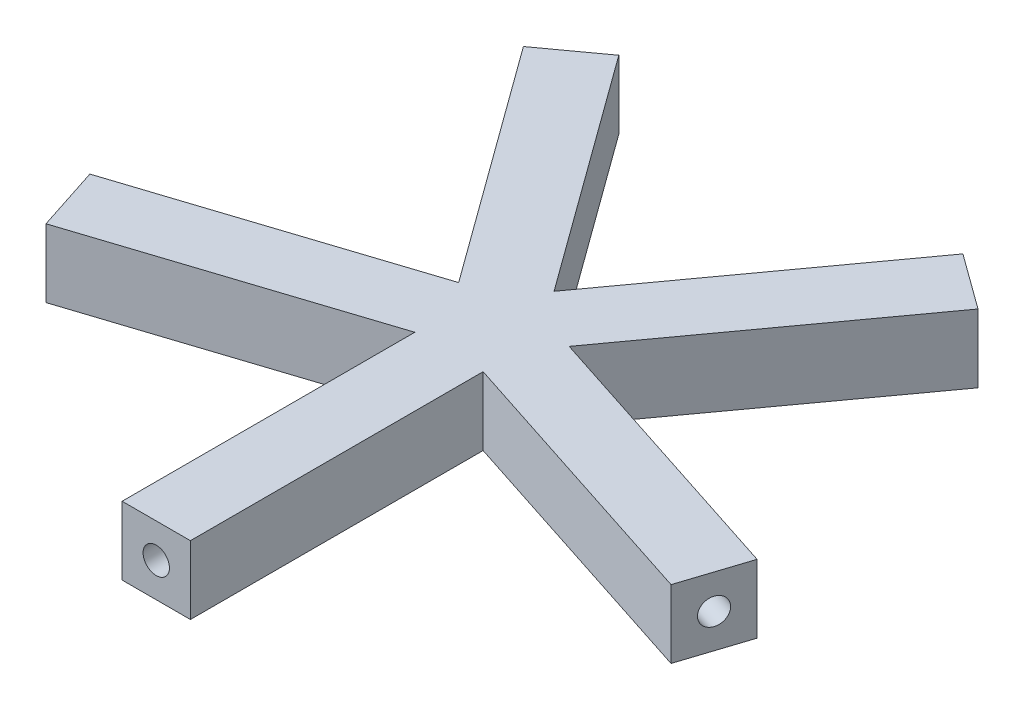
ISO-10303-21;
HEADER;
FILE_DESCRIPTION(('STEP AP214'),'2;1');
FILE_NAME('part.step','',(''),(''),'','','');
FILE_SCHEMA(('AUTOMOTIVE_DESIGN { 1 0 10303 214 1 1 1 1 }'));
ENDSEC;
DATA;
#1=APPLICATION_CONTEXT('core data for automotive mechanical design processes');
#2=APPLICATION_PROTOCOL_DEFINITION('international standard','automotive_design',2000,#1);
#3=PRODUCT_CONTEXT('',#1,'mechanical');
#4=PRODUCT('Part','Part','',(#3));
#5=PRODUCT_RELATED_PRODUCT_CATEGORY('part','',(#4));
#6=PRODUCT_DEFINITION_FORMATION('','',#4);
#7=PRODUCT_DEFINITION_CONTEXT('part definition',#1,'design');
#8=PRODUCT_DEFINITION('design','',#6,#7);
#9=PRODUCT_DEFINITION_SHAPE('','',#8);
#10=(LENGTH_UNIT() NAMED_UNIT(*) SI_UNIT(.MILLI.,.METRE.));
#11=(NAMED_UNIT(*) PLANE_ANGLE_UNIT() SI_UNIT($,.RADIAN.));
#12=(NAMED_UNIT(*) SI_UNIT($,.STERADIAN.) SOLID_ANGLE_UNIT());
#13=UNCERTAINTY_MEASURE_WITH_UNIT(LENGTH_MEASURE(1.E-05),#10,'distance_accuracy_value','');
#14=(GEOMETRIC_REPRESENTATION_CONTEXT(3) GLOBAL_UNCERTAINTY_ASSIGNED_CONTEXT((#13)) GLOBAL_UNIT_ASSIGNED_CONTEXT((#10,
#11,#12)) REPRESENTATION_CONTEXT('',''));
#15=CARTESIAN_POINT('',(0.,0.,0.));
#16=DIRECTION('',(0.,0.,1.));
#17=DIRECTION('',(1.,0.,0.));
#18=AXIS2_PLACEMENT_3D('',#15,#16,#17);
#19=CARTESIAN_POINT('',(-1.75,1.75,17.4086683608246));
#20=DIRECTION('',(0.,0.,-1.));
#21=DIRECTION('',(-1.,0.,0.));
#22=AXIS2_PLACEMENT_3D('',#19,#20,#21);
#23=PLANE('',#22);
#24=CARTESIAN_POINT('',(0.,0.,17.4086683608246));
#25=DIRECTION('',(0.,0.,1.));
#26=DIRECTION('',(1.,0.,0.));
#27=AXIS2_PLACEMENT_3D('',#24,#25,#26);
#28=CIRCLE('',#27,0.675);
#29=CARTESIAN_POINT('',(0.675,0.,17.4086683608246));
#30=VERTEX_POINT('',#29);
#31=EDGE_CURVE('E348',#30,#30,#28,.T.);
#32=ORIENTED_EDGE('',*,*,#31,.F.);
#33=EDGE_LOOP('',(#32));
#34=FACE_BOUND('',#33,.T.);
#35=DIRECTION('',(1.,0.,0.));
#36=VECTOR('',#35,1.);
#37=CARTESIAN_POINT('',(-1.75,-1.75,17.4086683608246));
#38=LINE('',#37,#36);
#39=CARTESIAN_POINT('',(-1.75,-1.75,17.4086683608246));
#40=VERTEX_POINT('',#39);
#41=CARTESIAN_POINT('',(1.75,-1.75,17.4086683608246));
#42=VERTEX_POINT('',#41);
#43=EDGE_CURVE('E182',#40,#42,#38,.T.);
#44=ORIENTED_EDGE('',*,*,#43,.T.);
#45=DIRECTION('',(0.,-1.,0.));
#46=VECTOR('',#45,1.);
#47=CARTESIAN_POINT('',(1.75,1.75,17.4086683608246));
#48=LINE('',#47,#46);
#49=CARTESIAN_POINT('',(1.75,1.75,17.4086683608246));
#50=VERTEX_POINT('',#49);
#51=EDGE_CURVE('E11',#50,#42,#48,.T.);
#52=ORIENTED_EDGE('',*,*,#51,.F.);
#53=DIRECTION('',(1.,0.,0.));
#54=VECTOR('',#53,1.);
#55=CARTESIAN_POINT('',(-1.75,1.75,17.4086683608246));
#56=LINE('',#55,#54);
#57=CARTESIAN_POINT('',(-1.75,1.75,17.4086683608246));
#58=VERTEX_POINT('',#57);
#59=EDGE_CURVE('E226',#58,#50,#56,.T.);
#60=ORIENTED_EDGE('',*,*,#59,.F.);
#61=DIRECTION('',(0.,-1.,0.));
#62=VECTOR('',#61,1.);
#63=CARTESIAN_POINT('',(-1.75,1.75,17.4086683608246));
#64=LINE('',#63,#62);
#65=EDGE_CURVE('E178',#58,#40,#64,.T.);
#66=ORIENTED_EDGE('',*,*,#65,.T.);
#67=EDGE_LOOP('',(#44,#52,#60,#66));
#68=FACE_BOUND('',#67,.T.);
#69=ADVANCED_FACE('F39',(#34,#68),#23,.F.);
#70=CARTESIAN_POINT('',(1.75000000000001,1.75,2.40866836082454));
#71=DIRECTION('',(-1.,0.,0.));
#72=DIRECTION('',(0.,0.,1.));
#73=AXIS2_PLACEMENT_3D('',#70,#71,#72);
#74=PLANE('',#73);
#75=DIRECTION('',(0.,0.,-1.));
#76=VECTOR('',#75,1.);
#77=CARTESIAN_POINT('',(1.75000000000001,-1.75,2.40866836082454));
#78=LINE('',#77,#76);
#79=CARTESIAN_POINT('',(1.75000000000001,-1.75,2.40866836082454));
#80=VERTEX_POINT('',#79);
#81=EDGE_CURVE('E186',#42,#80,#78,.T.);
#82=ORIENTED_EDGE('',*,*,#81,.T.);
#83=DIRECTION('',(0.,-1.,0.));
#84=VECTOR('',#83,1.);
#85=CARTESIAN_POINT('',(1.75000000000001,1.75,2.40866836082454));
#86=LINE('',#85,#84);
#87=CARTESIAN_POINT('',(1.75000000000001,1.75,2.40866836082454));
#88=VERTEX_POINT('',#87);
#89=EDGE_CURVE('E48',#88,#80,#86,.T.);
#90=ORIENTED_EDGE('',*,*,#89,.F.);
#91=DIRECTION('',(0.,0.,-1.));
#92=VECTOR('',#91,1.);
#93=CARTESIAN_POINT('',(1.75000000000001,1.75,2.40866836082454));
#94=LINE('',#93,#92);
#95=EDGE_CURVE('E120',#50,#88,#94,.T.);
#96=ORIENTED_EDGE('',*,*,#95,.F.);
#97=ORIENTED_EDGE('',*,*,#51,.T.);
#98=EDGE_LOOP('',(#82,#90,#96,#97));
#99=FACE_BOUND('',#98,.T.);
#100=ADVANCED_FACE('F341',(#99),#74,.F.);
#101=CARTESIAN_POINT('',(1.75000000000001,1.75,2.40866836082454));
#102=DIRECTION('',(0.309016994374945,0.,-0.951056516295154));
#103=DIRECTION('',(-0.951056516295155,0.,-0.309016994374945));
#104=AXIS2_PLACEMENT_3D('',#101,#102,#103);
#105=PLANE('',#104);
#106=DIRECTION('',(0.951056516295154,0.,0.309016994374945));
#107=VECTOR('',#106,1.);
#108=CARTESIAN_POINT('',(1.75000000000001,-1.75,2.40866836082454));
#109=LINE('',#108,#107);
#110=CARTESIAN_POINT('',(16.0158477444273,-1.75,7.04392327644871));
#111=VERTEX_POINT('',#110);
#112=EDGE_CURVE('E190',#80,#111,#109,.T.);
#113=ORIENTED_EDGE('',*,*,#112,.T.);
#114=DIRECTION('',(0.,-1.,0.));
#115=VECTOR('',#114,1.);
#116=CARTESIAN_POINT('',(16.0158477444273,1.75,7.04392327644871));
#117=LINE('',#116,#115);
#118=CARTESIAN_POINT('',(16.0158477444273,1.75,7.04392327644871));
#119=VERTEX_POINT('',#118);
#120=EDGE_CURVE('E265',#119,#111,#117,.T.);
#121=ORIENTED_EDGE('',*,*,#120,.F.);
#122=DIRECTION('',(0.951056516295154,0.,0.309016994374945));
#123=VECTOR('',#122,1.);
#124=CARTESIAN_POINT('',(1.75000000000001,1.75,2.40866836082454));
#125=LINE('',#124,#123);
#126=EDGE_CURVE('E275',#88,#119,#125,.T.);
#127=ORIENTED_EDGE('',*,*,#126,.F.);
#128=ORIENTED_EDGE('',*,*,#89,.T.);
#129=EDGE_LOOP('',(#113,#121,#127,#128));
#130=FACE_BOUND('',#129,.T.);
#131=ADVANCED_FACE('F273',(#130),#105,.F.);
#132=CARTESIAN_POINT('',(17.0974072247396,1.75,3.71522546941567));
#133=DIRECTION('',(-0.951056516295155,0.,-0.309016994374943));
#134=DIRECTION('',(-0.309016994374943,0.,0.951056516295155));
#135=AXIS2_PLACEMENT_3D('',#132,#133,#134);
#136=PLANE('',#135);
#137=CARTESIAN_POINT('',(16.5566274845835,0.,5.37957437293217));
#138=DIRECTION('',(0.951056516295155,0.,0.309016994374943));
#139=DIRECTION('',(0.309016994374943,0.,-0.951056516295155));
#140=AXIS2_PLACEMENT_3D('',#137,#138,#139);
#141=CIRCLE('',#140,0.675);
#142=CARTESIAN_POINT('',(16.7652139557866,0.,4.73761122443294));
#143=VERTEX_POINT('',#142);
#144=EDGE_CURVE('E358',#143,#143,#141,.T.);
#145=ORIENTED_EDGE('',*,*,#144,.F.);
#146=EDGE_LOOP('',(#145));
#147=FACE_BOUND('',#146,.T.);
#148=DIRECTION('',(0.309016994374943,0.,-0.951056516295155));
#149=VECTOR('',#148,1.);
#150=CARTESIAN_POINT('',(17.0974072247396,-1.75,3.71522546941567));
#151=LINE('',#150,#149);
#152=CARTESIAN_POINT('',(17.0974072247396,-1.75,3.71522546941567));
#153=VERTEX_POINT('',#152);
#154=EDGE_CURVE('E193',#111,#153,#151,.T.);
#155=ORIENTED_EDGE('',*,*,#154,.T.);
#156=DIRECTION('',(0.,-1.,0.));
#157=VECTOR('',#156,1.);
#158=CARTESIAN_POINT('',(17.0974072247396,1.75,3.71522546941567));
#159=LINE('',#158,#157);
#160=CARTESIAN_POINT('',(17.0974072247396,1.75,3.71522546941567));
#161=VERTEX_POINT('',#160);
#162=EDGE_CURVE('E261',#161,#153,#159,.T.);
#163=ORIENTED_EDGE('',*,*,#162,.F.);
#164=DIRECTION('',(0.309016994374943,0.,-0.951056516295155));
#165=VECTOR('',#164,1.);
#166=CARTESIAN_POINT('',(17.0974072247396,1.75,3.71522546941567));
#167=LINE('',#166,#165);
#168=EDGE_CURVE('E294',#119,#161,#167,.T.);
#169=ORIENTED_EDGE('',*,*,#168,.F.);
#170=ORIENTED_EDGE('',*,*,#120,.T.);
#171=EDGE_LOOP('',(#155,#163,#169,#170));
#172=FACE_BOUND('',#171,.T.);
#173=ADVANCED_FACE('F284',(#147,#172),#136,.F.);
#174=CARTESIAN_POINT('',(2.8315594803123,1.75,-0.920029446208489));
#175=DIRECTION('',(-0.309016994374944,0.,0.951056516295155));
#176=DIRECTION('',(0.951056516295155,0.,0.309016994374944));
#177=AXIS2_PLACEMENT_3D('',#174,#175,#176);
#178=PLANE('',#177);
#179=DIRECTION('',(-0.951056516295155,0.,-0.309016994374944));
#180=VECTOR('',#179,1.);
#181=CARTESIAN_POINT('',(2.8315594803123,-1.75,-0.920029446208489));
#182=LINE('',#181,#180);
#183=CARTESIAN_POINT('',(2.8315594803123,-1.75,-0.920029446208489));
#184=VERTEX_POINT('',#183);
#185=EDGE_CURVE('E196',#153,#184,#182,.T.);
#186=ORIENTED_EDGE('',*,*,#185,.T.);
#187=DIRECTION('',(0.,-1.,0.));
#188=VECTOR('',#187,1.);
#189=CARTESIAN_POINT('',(2.8315594803123,1.75,-0.920029446208489));
#190=LINE('',#189,#188);
#191=CARTESIAN_POINT('',(2.8315594803123,1.75,-0.920029446208489));
#192=VERTEX_POINT('',#191);
#193=EDGE_CURVE('E257',#192,#184,#190,.T.);
#194=ORIENTED_EDGE('',*,*,#193,.F.);
#195=DIRECTION('',(-0.951056516295155,0.,-0.309016994374944));
#196=VECTOR('',#195,1.);
#197=CARTESIAN_POINT('',(2.8315594803123,1.75,-0.920029446208489));
#198=LINE('',#197,#196);
#199=EDGE_CURVE('E290',#161,#192,#198,.T.);
#200=ORIENTED_EDGE('',*,*,#199,.F.);
#201=ORIENTED_EDGE('',*,*,#162,.T.);
#202=EDGE_LOOP('',(#186,#194,#200,#201));
#203=FACE_BOUND('',#202,.T.);
#204=ADVANCED_FACE('F288',(#203),#178,.F.);
#205=CARTESIAN_POINT('',(11.6483382646994,1.75,-13.0552843618327));
#206=DIRECTION('',(-0.809016994374947,0.,-0.587785252292474));
#207=DIRECTION('',(-0.587785252292474,0.,0.809016994374947));
#208=AXIS2_PLACEMENT_3D('',#205,#206,#207);
#209=PLANE('',#208);
#210=DIRECTION('',(0.587785252292474,0.,-0.809016994374947));
#211=VECTOR('',#210,1.);
#212=CARTESIAN_POINT('',(11.6483382646994,-1.75,-13.0552843618327));
#213=LINE('',#212,#211);
#214=CARTESIAN_POINT('',(11.6483382646994,-1.75,-13.0552843618327));
#215=VERTEX_POINT('',#214);
#216=EDGE_CURVE('E199',#184,#215,#213,.T.);
#217=ORIENTED_EDGE('',*,*,#216,.T.);
#218=DIRECTION('',(0.,-1.,0.));
#219=VECTOR('',#218,1.);
#220=CARTESIAN_POINT('',(11.6483382646994,1.75,-13.0552843618327));
#221=LINE('',#220,#219);
#222=CARTESIAN_POINT('',(11.6483382646994,1.75,-13.0552843618327));
#223=VERTEX_POINT('',#222);
#224=EDGE_CURVE('E253',#223,#215,#221,.T.);
#225=ORIENTED_EDGE('',*,*,#224,.F.);
#226=DIRECTION('',(0.587785252292474,0.,-0.809016994374947));
#227=VECTOR('',#226,1.);
#228=CARTESIAN_POINT('',(11.6483382646994,1.75,-13.0552843618327));
#229=LINE('',#228,#227);
#230=EDGE_CURVE('E293',#192,#223,#229,.T.);
#231=ORIENTED_EDGE('',*,*,#230,.F.);
#232=ORIENTED_EDGE('',*,*,#193,.T.);
#233=EDGE_LOOP('',(#217,#225,#231,#232));
#234=FACE_BOUND('',#233,.T.);
#235=ADVANCED_FACE('F427',(#234),#209,.F.);
#236=CARTESIAN_POINT('',(8.81677878438712,1.75,-15.1125327448564));
#237=DIRECTION('',(-0.587785252292487,0.,0.809016994374938));
#238=DIRECTION('',(0.809016994374938,0.,0.587785252292487));
#239=AXIS2_PLACEMENT_3D('',#236,#237,#238);
#240=PLANE('',#239);
#241=CARTESIAN_POINT('',(10.2325585245435,0.,-14.0839085533444));
#242=DIRECTION('',(0.587785252292487,0.,-0.809016994374938));
#243=DIRECTION('',(-0.809016994374938,0.,-0.587785252292487));
#244=AXIS2_PLACEMENT_3D('',#241,#242,#243);
#245=CIRCLE('',#244,0.674999999999998);
#246=CARTESIAN_POINT('',(9.68647205334042,0.,-14.4806635986418));
#247=VERTEX_POINT('',#246);
#248=EDGE_CURVE('E370',#247,#247,#245,.T.);
#249=ORIENTED_EDGE('',*,*,#248,.F.);
#250=EDGE_LOOP('',(#249));
#251=FACE_BOUND('',#250,.T.);
#252=DIRECTION('',(-0.809016994374938,0.,-0.587785252292487));
#253=VECTOR('',#252,1.);
#254=CARTESIAN_POINT('',(8.81677878438712,-1.75,-15.1125327448564));
#255=LINE('',#254,#253);
#256=CARTESIAN_POINT('',(8.81677878438712,-1.75,-15.1125327448564));
#257=VERTEX_POINT('',#256);
#258=EDGE_CURVE('E202',#215,#257,#255,.T.);
#259=ORIENTED_EDGE('',*,*,#258,.T.);
#260=DIRECTION('',(0.,-1.,0.));
#261=VECTOR('',#260,1.);
#262=CARTESIAN_POINT('',(8.81677878438712,1.75,-15.1125327448564));
#263=LINE('',#262,#261);
#264=CARTESIAN_POINT('',(8.81677878438712,1.75,-15.1125327448564));
#265=VERTEX_POINT('',#264);
#266=EDGE_CURVE('E249',#265,#257,#263,.T.);
#267=ORIENTED_EDGE('',*,*,#266,.F.);
#268=DIRECTION('',(-0.809016994374938,0.,-0.587785252292487));
#269=VECTOR('',#268,1.);
#270=CARTESIAN_POINT('',(8.81677878438712,1.75,-15.1125327448564));
#271=LINE('',#270,#269);
#272=EDGE_CURVE('E298',#223,#265,#271,.T.);
#273=ORIENTED_EDGE('',*,*,#272,.F.);
#274=ORIENTED_EDGE('',*,*,#224,.T.);
#275=EDGE_LOOP('',(#259,#267,#273,#274));
#276=FACE_BOUND('',#275,.T.);
#277=ADVANCED_FACE('F423',(#251,#276),#240,.F.);
#278=CARTESIAN_POINT('',(8.81677878438712,1.75,-15.1125327448564));
#279=DIRECTION('',(0.809016994374941,0.,0.587785252292482));
#280=DIRECTION('',(0.587785252292482,0.,-0.809016994374941));
#281=AXIS2_PLACEMENT_3D('',#278,#279,#280);
#282=PLANE('',#281);
#283=DIRECTION('',(-0.587785252292482,0.,0.809016994374941));
#284=VECTOR('',#283,1.);
#285=CARTESIAN_POINT('',(8.81677878438712,-1.75,-15.1125327448564));
#286=LINE('',#285,#284);
#287=CARTESIAN_POINT('',(-1.03481303965786E-13,-1.75,-2.97727782923228));
#288=VERTEX_POINT('',#287);
#289=EDGE_CURVE('E205',#257,#288,#286,.T.);
#290=ORIENTED_EDGE('',*,*,#289,.T.);
#291=DIRECTION('',(0.,-1.,0.));
#292=VECTOR('',#291,1.);
#293=CARTESIAN_POINT('',(-1.03481303965786E-13,1.75,-2.97727782923228));
#294=LINE('',#293,#292);
#295=CARTESIAN_POINT('',(-1.03481303965786E-13,1.75,-2.97727782923228));
#296=VERTEX_POINT('',#295);
#297=EDGE_CURVE('E245',#296,#288,#294,.T.);
#298=ORIENTED_EDGE('',*,*,#297,.F.);
#299=DIRECTION('',(-0.587785252292482,0.,0.809016994374941));
#300=VECTOR('',#299,1.);
#301=CARTESIAN_POINT('',(8.81677878438712,1.75,-15.1125327448564));
#302=LINE('',#301,#300);
#303=EDGE_CURVE('E305',#265,#296,#302,.T.);
#304=ORIENTED_EDGE('',*,*,#303,.F.);
#305=ORIENTED_EDGE('',*,*,#266,.T.);
#306=EDGE_LOOP('',(#290,#298,#304,#305));
#307=FACE_BOUND('',#306,.T.);
#308=ADVANCED_FACE('F419',(#307),#282,.F.);
#309=CARTESIAN_POINT('',(-1.03481303965786E-13,1.75,-2.97727782923228));
#310=DIRECTION('',(-0.809016994374947,0.,0.587785252292474));
#311=DIRECTION('',(0.587785252292474,0.,0.809016994374947));
#312=AXIS2_PLACEMENT_3D('',#309,#310,#311);
#313=PLANE('',#312);
#314=DIRECTION('',(-0.587785252292474,0.,-0.809016994374947));
#315=VECTOR('',#314,1.);
#316=CARTESIAN_POINT('',(-1.03481303965786E-13,-1.75,-2.97727782923228));
#317=LINE('',#316,#315);
#318=CARTESIAN_POINT('',(-8.81677878438711,-1.75,-15.1125327448563));
#319=VERTEX_POINT('',#318);
#320=EDGE_CURVE('E208',#288,#319,#317,.T.);
#321=ORIENTED_EDGE('',*,*,#320,.T.);
#322=DIRECTION('',(0.,-1.,0.));
#323=VECTOR('',#322,1.);
#324=CARTESIAN_POINT('',(-8.81677878438711,1.75,-15.1125327448563));
#325=LINE('',#324,#323);
#326=CARTESIAN_POINT('',(-8.81677878438711,1.75,-15.1125327448563));
#327=VERTEX_POINT('',#326);
#328=EDGE_CURVE('E241',#327,#319,#325,.T.);
#329=ORIENTED_EDGE('',*,*,#328,.F.);
#330=DIRECTION('',(-0.587785252292474,0.,-0.809016994374947));
#331=VECTOR('',#330,1.);
#332=CARTESIAN_POINT('',(-1.03481303965786E-13,1.75,-2.97727782923228));
#333=LINE('',#332,#331);
#334=EDGE_CURVE('E308',#296,#327,#333,.T.);
#335=ORIENTED_EDGE('',*,*,#334,.F.);
#336=ORIENTED_EDGE('',*,*,#297,.T.);
#337=EDGE_LOOP('',(#321,#329,#335,#336));
#338=FACE_BOUND('',#337,.T.);
#339=ADVANCED_FACE('F415',(#338),#313,.F.);
#340=CARTESIAN_POINT('',(-8.81677878438711,1.75,-15.1125327448563));
#341=DIRECTION('',(0.587785252292473,0.,0.809016994374948));
#342=DIRECTION('',(0.809016994374948,0.,-0.587785252292473));
#343=AXIS2_PLACEMENT_3D('',#340,#341,#342);
#344=PLANE('',#343);
#345=CARTESIAN_POINT('',(-10.2325585245433,0.,-14.0839085533445));
#346=DIRECTION('',(-0.587785252292473,0.,-0.809016994374948));
#347=DIRECTION('',(-0.809016994374947,0.,0.587785252292473));
#348=AXIS2_PLACEMENT_3D('',#345,#346,#347);
#349=CIRCLE('',#348,0.674999999999999);
#350=CARTESIAN_POINT('',(-10.7786449957463,0.,-13.6871535080471));
#351=VERTEX_POINT('',#350);
#352=EDGE_CURVE('E378',#351,#351,#349,.T.);
#353=ORIENTED_EDGE('',*,*,#352,.F.);
#354=EDGE_LOOP('',(#353));
#355=FACE_BOUND('',#354,.T.);
#356=DIRECTION('',(-0.809016994374948,0.,0.587785252292473));
#357=VECTOR('',#356,1.);
#358=CARTESIAN_POINT('',(-8.81677878438711,-1.75,-15.1125327448563));
#359=LINE('',#358,#357);
#360=CARTESIAN_POINT('',(-11.6483382646994,-1.75,-13.0552843618327));
#361=VERTEX_POINT('',#360);
#362=EDGE_CURVE('E211',#319,#361,#359,.T.);
#363=ORIENTED_EDGE('',*,*,#362,.T.);
#364=DIRECTION('',(0.,-1.,0.));
#365=VECTOR('',#364,1.);
#366=CARTESIAN_POINT('',(-11.6483382646994,1.75,-13.0552843618327));
#367=LINE('',#366,#365);
#368=CARTESIAN_POINT('',(-11.6483382646994,1.75,-13.0552843618327));
#369=VERTEX_POINT('',#368);
#370=EDGE_CURVE('E237',#369,#361,#367,.T.);
#371=ORIENTED_EDGE('',*,*,#370,.F.);
#372=DIRECTION('',(-0.809016994374948,0.,0.587785252292473));
#373=VECTOR('',#372,1.);
#374=CARTESIAN_POINT('',(-8.81677878438711,1.75,-15.1125327448563));
#375=LINE('',#374,#373);
#376=EDGE_CURVE('E311',#327,#369,#375,.T.);
#377=ORIENTED_EDGE('',*,*,#376,.F.);
#378=ORIENTED_EDGE('',*,*,#328,.T.);
#379=EDGE_LOOP('',(#363,#371,#377,#378));
#380=FACE_BOUND('',#379,.T.);
#381=ADVANCED_FACE('F412',(#355,#380),#344,.F.);
#382=CARTESIAN_POINT('',(-11.6483382646994,1.75,-13.0552843618327));
#383=DIRECTION('',(0.809016994374947,0.,-0.587785252292474));
#384=DIRECTION('',(-0.587785252292474,0.,-0.809016994374947));
#385=AXIS2_PLACEMENT_3D('',#382,#383,#384);
#386=PLANE('',#385);
#387=DIRECTION('',(0.587785252292474,0.,0.809016994374947));
#388=VECTOR('',#387,1.);
#389=CARTESIAN_POINT('',(-11.6483382646994,-1.75,-13.0552843618327));
#390=LINE('',#389,#388);
#391=CARTESIAN_POINT('',(-2.83155948031232,-1.75,-0.920029446208494));
#392=VERTEX_POINT('',#391);
#393=EDGE_CURVE('E214',#361,#392,#390,.T.);
#394=ORIENTED_EDGE('',*,*,#393,.T.);
#395=DIRECTION('',(0.,-1.,0.));
#396=VECTOR('',#395,1.);
#397=CARTESIAN_POINT('',(-2.83155948031232,1.75,-0.920029446208494));
#398=LINE('',#397,#396);
#399=CARTESIAN_POINT('',(-2.83155948031232,1.75,-0.920029446208494));
#400=VERTEX_POINT('',#399);
#401=EDGE_CURVE('E233',#400,#392,#398,.T.);
#402=ORIENTED_EDGE('',*,*,#401,.F.);
#403=DIRECTION('',(0.587785252292474,0.,0.809016994374947));
#404=VECTOR('',#403,1.);
#405=CARTESIAN_POINT('',(-11.6483382646994,1.75,-13.0552843618327));
#406=LINE('',#405,#404);
#407=EDGE_CURVE('E314',#369,#400,#406,.T.);
#408=ORIENTED_EDGE('',*,*,#407,.F.);
#409=ORIENTED_EDGE('',*,*,#370,.T.);
#410=EDGE_LOOP('',(#394,#402,#408,#409));
#411=FACE_BOUND('',#410,.T.);
#412=ADVANCED_FACE('F322',(#411),#386,.F.);
#413=CARTESIAN_POINT('',(-17.0974072247396,1.75,3.71522546941577));
#414=DIRECTION('',(0.309016994374951,0.,0.951056516295152));
#415=DIRECTION('',(0.951056516295153,0.,-0.309016994374951));
#416=AXIS2_PLACEMENT_3D('',#413,#414,#415);
#417=PLANE('',#416);
#418=DIRECTION('',(-0.951056516295152,0.,0.309016994374951));
#419=VECTOR('',#418,1.);
#420=CARTESIAN_POINT('',(-17.0974072247396,-1.75,3.71522546941577));
#421=LINE('',#420,#419);
#422=CARTESIAN_POINT('',(-17.0974072247396,-1.75,3.71522546941577));
#423=VERTEX_POINT('',#422);
#424=EDGE_CURVE('E217',#392,#423,#421,.T.);
#425=ORIENTED_EDGE('',*,*,#424,.T.);
#426=DIRECTION('',(0.,-1.,0.));
#427=VECTOR('',#426,1.);
#428=CARTESIAN_POINT('',(-17.0974072247396,1.75,3.71522546941577));
#429=LINE('',#428,#427);
#430=CARTESIAN_POINT('',(-17.0974072247396,1.75,3.71522546941577));
#431=VERTEX_POINT('',#430);
#432=EDGE_CURVE('E171',#431,#423,#429,.T.);
#433=ORIENTED_EDGE('',*,*,#432,.F.);
#434=DIRECTION('',(-0.951056516295152,0.,0.309016994374951));
#435=VECTOR('',#434,1.);
#436=CARTESIAN_POINT('',(-17.0974072247396,1.75,3.71522546941577));
#437=LINE('',#436,#435);
#438=EDGE_CURVE('E160',#400,#431,#437,.T.);
#439=ORIENTED_EDGE('',*,*,#438,.F.);
#440=ORIENTED_EDGE('',*,*,#401,.T.);
#441=EDGE_LOOP('',(#425,#433,#439,#440));
#442=FACE_BOUND('',#441,.T.);
#443=ADVANCED_FACE('F326',(#442),#417,.F.);
#444=CARTESIAN_POINT('',(-17.0974072247396,1.75,3.71522546941577));
#445=DIRECTION('',(0.951056516295152,0.,-0.309016994374952));
#446=DIRECTION('',(-0.309016994374952,0.,-0.951056516295152));
#447=AXIS2_PLACEMENT_3D('',#444,#445,#446);
#448=PLANE('',#447);
#449=CARTESIAN_POINT('',(-16.5566274845834,0.,5.37957437293232));
#450=DIRECTION('',(-0.951056516295152,0.,0.309016994374952));
#451=DIRECTION('',(0.309016994374952,0.,0.951056516295152));
#452=AXIS2_PLACEMENT_3D('',#449,#450,#451);
#453=CIRCLE('',#452,0.675);
#454=CARTESIAN_POINT('',(-16.3480410133803,0.,6.02153752143154));
#455=VERTEX_POINT('',#454);
#456=EDGE_CURVE('E386',#455,#455,#453,.T.);
#457=ORIENTED_EDGE('',*,*,#456,.F.);
#458=EDGE_LOOP('',(#457));
#459=FACE_BOUND('',#458,.T.);
#460=DIRECTION('',(0.309016994374952,0.,0.951056516295152));
#461=VECTOR('',#460,1.);
#462=CARTESIAN_POINT('',(-17.0974072247396,-1.75,3.71522546941577));
#463=LINE('',#462,#461);
#464=CARTESIAN_POINT('',(-16.0158477444273,-1.75,7.04392327644881));
#465=VERTEX_POINT('',#464);
#466=EDGE_CURVE('E169',#423,#465,#463,.T.);
#467=ORIENTED_EDGE('',*,*,#466,.T.);
#468=DIRECTION('',(0.,-1.,0.));
#469=VECTOR('',#468,1.);
#470=CARTESIAN_POINT('',(-16.0158477444273,1.75,7.04392327644881));
#471=LINE('',#470,#469);
#472=CARTESIAN_POINT('',(-16.0158477444273,1.75,7.04392327644881));
#473=VERTEX_POINT('',#472);
#474=EDGE_CURVE('E166',#473,#465,#471,.T.);
#475=ORIENTED_EDGE('',*,*,#474,.F.);
#476=DIRECTION('',(0.309016994374952,0.,0.951056516295152));
#477=VECTOR('',#476,1.);
#478=CARTESIAN_POINT('',(-17.0974072247396,1.75,3.71522546941577));
#479=LINE('',#478,#477);
#480=EDGE_CURVE('E154',#431,#473,#479,.T.);
#481=ORIENTED_EDGE('',*,*,#480,.F.);
#482=ORIENTED_EDGE('',*,*,#432,.T.);
#483=EDGE_LOOP('',(#467,#475,#481,#482));
#484=FACE_BOUND('',#483,.T.);
#485=ADVANCED_FACE('F167',(#459,#484),#448,.F.);
#486=CARTESIAN_POINT('',(-16.0158477444273,1.75,7.04392327644881));
#487=DIRECTION('',(-0.309016994374951,0.,-0.951056516295152));
#488=DIRECTION('',(-0.951056516295153,0.,0.309016994374951));
#489=AXIS2_PLACEMENT_3D('',#486,#487,#488);
#490=PLANE('',#489);
#491=DIRECTION('',(0.951056516295152,0.,-0.309016994374951));
#492=VECTOR('',#491,1.);
#493=CARTESIAN_POINT('',(-16.0158477444273,-1.75,7.04392327644881));
#494=LINE('',#493,#492);
#495=CARTESIAN_POINT('',(-1.75,-1.75,2.40866836082454));
#496=VERTEX_POINT('',#495);
#497=EDGE_CURVE('E106',#465,#496,#494,.T.);
#498=ORIENTED_EDGE('',*,*,#497,.T.);
#499=DIRECTION('',(0.,-1.,0.));
#500=VECTOR('',#499,1.);
#501=CARTESIAN_POINT('',(-1.75,1.75,2.40866836082454));
#502=LINE('',#501,#500);
#503=CARTESIAN_POINT('',(-1.75,1.75,2.40866836082454));
#504=VERTEX_POINT('',#503);
#505=EDGE_CURVE('E172',#504,#496,#502,.T.);
#506=ORIENTED_EDGE('',*,*,#505,.F.);
#507=DIRECTION('',(0.951056516295152,0.,-0.309016994374951));
#508=VECTOR('',#507,1.);
#509=CARTESIAN_POINT('',(-16.0158477444273,1.75,7.04392327644881));
#510=LINE('',#509,#508);
#511=EDGE_CURVE('E158',#473,#504,#510,.T.);
#512=ORIENTED_EDGE('',*,*,#511,.F.);
#513=ORIENTED_EDGE('',*,*,#474,.T.);
#514=EDGE_LOOP('',(#498,#506,#512,#513));
#515=FACE_BOUND('',#514,.T.);
#516=ADVANCED_FACE('F174',(#515),#490,.F.);
#517=CARTESIAN_POINT('',(-1.75,1.75,2.40866836082454));
#518=DIRECTION('',(1.,0.,0.));
#519=DIRECTION('',(0.,0.,-1.));
#520=AXIS2_PLACEMENT_3D('',#517,#518,#519);
#521=PLANE('',#520);
#522=DIRECTION('',(0.,0.,1.));
#523=VECTOR('',#522,1.);
#524=CARTESIAN_POINT('',(-1.75,-1.75,2.40866836082454));
#525=LINE('',#524,#523);
#526=EDGE_CURVE('E112',#496,#40,#525,.T.);
#527=ORIENTED_EDGE('',*,*,#526,.T.);
#528=ORIENTED_EDGE('',*,*,#65,.F.);
#529=DIRECTION('',(0.,0.,1.));
#530=VECTOR('',#529,1.);
#531=CARTESIAN_POINT('',(-1.75,1.75,2.40866836082454));
#532=LINE('',#531,#530);
#533=EDGE_CURVE('E56',#504,#58,#532,.T.);
#534=ORIENTED_EDGE('',*,*,#533,.F.);
#535=ORIENTED_EDGE('',*,*,#505,.T.);
#536=EDGE_LOOP('',(#527,#528,#534,#535));
#537=FACE_BOUND('',#536,.T.);
#538=ADVANCED_FACE('F330',(#537),#521,.F.);
#539=CARTESIAN_POINT('',(0.,1.75,0.));
#540=DIRECTION('',(0.,-1.,0.));
#541=DIRECTION('',(0.,0.,-1.));
#542=AXIS2_PLACEMENT_3D('',#539,#540,#541);
#543=PLANE('',#542);
#544=ORIENTED_EDGE('',*,*,#59,.T.);
#545=ORIENTED_EDGE('',*,*,#95,.T.);
#546=ORIENTED_EDGE('',*,*,#126,.T.);
#547=ORIENTED_EDGE('',*,*,#168,.T.);
#548=ORIENTED_EDGE('',*,*,#199,.T.);
#549=ORIENTED_EDGE('',*,*,#230,.T.);
#550=ORIENTED_EDGE('',*,*,#272,.T.);
#551=ORIENTED_EDGE('',*,*,#303,.T.);
#552=ORIENTED_EDGE('',*,*,#334,.T.);
#553=ORIENTED_EDGE('',*,*,#376,.T.);
#554=ORIENTED_EDGE('',*,*,#407,.T.);
#555=ORIENTED_EDGE('',*,*,#438,.T.);
#556=ORIENTED_EDGE('',*,*,#480,.T.);
#557=ORIENTED_EDGE('',*,*,#511,.T.);
#558=ORIENTED_EDGE('',*,*,#533,.T.);
#559=EDGE_LOOP('',(#544,#545,#546,#547,#548,#549,#550,#551,#552,#553,#554,#555,#556,#557,#558));
#560=FACE_BOUND('',#559,.T.);
#561=ADVANCED_FACE('F156',(#560),#543,.F.);
#562=CARTESIAN_POINT('',(0.,-1.75,0.));
#563=DIRECTION('',(0.,-1.,0.));
#564=DIRECTION('',(0.,0.,-1.));
#565=AXIS2_PLACEMENT_3D('',#562,#563,#564);
#566=PLANE('',#565);
#567=ORIENTED_EDGE('',*,*,#43,.F.);
#568=ORIENTED_EDGE('',*,*,#526,.F.);
#569=ORIENTED_EDGE('',*,*,#497,.F.);
#570=ORIENTED_EDGE('',*,*,#466,.F.);
#571=ORIENTED_EDGE('',*,*,#424,.F.);
#572=ORIENTED_EDGE('',*,*,#393,.F.);
#573=ORIENTED_EDGE('',*,*,#362,.F.);
#574=ORIENTED_EDGE('',*,*,#320,.F.);
#575=ORIENTED_EDGE('',*,*,#289,.F.);
#576=ORIENTED_EDGE('',*,*,#258,.F.);
#577=ORIENTED_EDGE('',*,*,#216,.F.);
#578=ORIENTED_EDGE('',*,*,#185,.F.);
#579=ORIENTED_EDGE('',*,*,#154,.F.);
#580=ORIENTED_EDGE('',*,*,#112,.F.);
#581=ORIENTED_EDGE('',*,*,#81,.F.);
#582=EDGE_LOOP('',(#567,#568,#569,#570,#571,#572,#573,#574,#575,#576,#577,#578,#579,#580,#581));
#583=FACE_BOUND('',#582,.T.);
#584=ADVANCED_FACE('F279',(#583),#566,.T.);
#585=CARTESIAN_POINT('',(0.,0.,2.40866836082458));
#586=DIRECTION('',(0.,0.,1.));
#587=DIRECTION('',(1.,0.,0.));
#588=AXIS2_PLACEMENT_3D('',#585,#586,#587);
#589=CYLINDRICAL_SURFACE('',#588,0.675);
#590=CARTESIAN_POINT('',(0.,0.,2.40866836082458));
#591=DIRECTION('',(0.,0.,1.));
#592=DIRECTION('',(1.,0.,0.));
#593=AXIS2_PLACEMENT_3D('',#590,#591,#592);
#594=CIRCLE('',#593,0.675);
#595=CARTESIAN_POINT('',(0.675,0.,2.40866836082458));
#596=VERTEX_POINT('',#595);
#597=EDGE_CURVE('E187',#596,#596,#594,.T.);
#598=ORIENTED_EDGE('',*,*,#597,.F.);
#599=EDGE_LOOP('',(#598));
#600=FACE_BOUND('',#599,.T.);
#601=ORIENTED_EDGE('',*,*,#31,.T.);
#602=EDGE_LOOP('',(#601));
#603=FACE_BOUND('',#602,.T.);
#604=ADVANCED_FACE('F509',(#600,#603),#589,.F.);
#605=CARTESIAN_POINT('',(0.,0.,2.40866836082458));
#606=DIRECTION('',(0.,0.,1.));
#607=DIRECTION('',(1.,0.,0.));
#608=AXIS2_PLACEMENT_3D('',#605,#606,#607);
#609=PLANE('',#608);
#610=ORIENTED_EDGE('',*,*,#597,.T.);
#611=EDGE_LOOP('',(#610));
#612=FACE_BOUND('',#611,.T.);
#613=ADVANCED_FACE('F522',(#612),#609,.T.);
#614=CARTESIAN_POINT('',(2.29077974015616,0.,0.744319457308022));
#615=DIRECTION('',(0.951056516295155,0.,0.309016994374943));
#616=DIRECTION('',(0.309016994374943,0.,-0.951056516295155));
#617=AXIS2_PLACEMENT_3D('',#614,#615,#616);
#618=CYLINDRICAL_SURFACE('',#617,0.675);
#619=CARTESIAN_POINT('',(2.29077974015616,0.,0.744319457308022));
#620=DIRECTION('',(0.951056516295155,0.,0.309016994374943));
#621=DIRECTION('',(0.309016994374943,0.,-0.951056516295155));
#622=AXIS2_PLACEMENT_3D('',#619,#620,#621);
#623=CIRCLE('',#622,0.675);
#624=CARTESIAN_POINT('',(2.49936621135925,0.,0.102356308808793));
#625=VERTEX_POINT('',#624);
#626=EDGE_CURVE('E351',#625,#625,#623,.T.);
#627=ORIENTED_EDGE('',*,*,#626,.F.);
#628=EDGE_LOOP('',(#627));
#629=FACE_BOUND('',#628,.T.);
#630=ORIENTED_EDGE('',*,*,#144,.T.);
#631=EDGE_LOOP('',(#630));
#632=FACE_BOUND('',#631,.T.);
#633=ADVANCED_FACE('F531',(#629,#632),#618,.F.);
#634=CARTESIAN_POINT('',(2.29077974015616,0.,0.744319457308022));
#635=DIRECTION('',(0.951056516295155,0.,0.309016994374943));
#636=DIRECTION('',(0.309016994374943,0.,-0.951056516295155));
#637=AXIS2_PLACEMENT_3D('',#634,#635,#636);
#638=PLANE('',#637);
#639=ORIENTED_EDGE('',*,*,#626,.T.);
#640=EDGE_LOOP('',(#639));
#641=FACE_BOUND('',#640,.T.);
#642=ADVANCED_FACE('F541',(#641),#638,.T.);
#643=CARTESIAN_POINT('',(1.41577974015621,0.,-1.94865363772031));
#644=DIRECTION('',(0.587785252292486,0.,-0.809016994374938));
#645=DIRECTION('',(-0.809016994374938,0.,-0.587785252292487));
#646=AXIS2_PLACEMENT_3D('',#643,#644,#645);
#647=CYLINDRICAL_SURFACE('',#646,0.674999999999998);
#648=CARTESIAN_POINT('',(1.41577974015621,0.,-1.94865363772031));
#649=DIRECTION('',(0.587785252292487,0.,-0.809016994374938));
#650=DIRECTION('',(-0.809016994374938,0.,-0.587785252292487));
#651=AXIS2_PLACEMENT_3D('',#648,#649,#650);
#652=CIRCLE('',#651,0.674999999999998);
#653=CARTESIAN_POINT('',(0.869693268953124,0.,-2.34540868301774));
#654=VERTEX_POINT('',#653);
#655=EDGE_CURVE('E368',#654,#654,#652,.T.);
#656=ORIENTED_EDGE('',*,*,#655,.F.);
#657=EDGE_LOOP('',(#656));
#658=FACE_BOUND('',#657,.T.);
#659=ORIENTED_EDGE('',*,*,#248,.T.);
#660=EDGE_LOOP('',(#659));
#661=FACE_BOUND('',#660,.T.);
#662=ADVANCED_FACE('F547',(#658,#661),#647,.F.);
#663=CARTESIAN_POINT('',(1.41577974015621,0.,-1.94865363772031));
#664=DIRECTION('',(0.587785252292487,0.,-0.809016994374938));
#665=DIRECTION('',(-0.809016994374938,0.,-0.587785252292487));
#666=AXIS2_PLACEMENT_3D('',#663,#664,#665);
#667=PLANE('',#666);
#668=ORIENTED_EDGE('',*,*,#655,.T.);
#669=EDGE_LOOP('',(#668));
#670=FACE_BOUND('',#669,.T.);
#671=ADVANCED_FACE('F554',(#670),#667,.T.);
#672=CARTESIAN_POINT('',(-1.41577974015616,0.,-1.94865363772031));
#673=DIRECTION('',(-0.587785252292473,0.,-0.809016994374948));
#674=DIRECTION('',(-0.809016994374948,0.,0.587785252292473));
#675=AXIS2_PLACEMENT_3D('',#672,#673,#674);
#676=CYLINDRICAL_SURFACE('',#675,0.674999999999999);
#677=CARTESIAN_POINT('',(-1.41577974015616,0.,-1.94865363772031));
#678=DIRECTION('',(-0.587785252292473,0.,-0.809016994374948));
#679=DIRECTION('',(-0.809016994374947,0.,0.587785252292473));
#680=AXIS2_PLACEMENT_3D('',#677,#678,#679);
#681=CIRCLE('',#680,0.674999999999999);
#682=CARTESIAN_POINT('',(-1.96186621135924,0.,-1.55189859242289));
#683=VERTEX_POINT('',#682);
#684=EDGE_CURVE('E374',#683,#683,#681,.T.);
#685=ORIENTED_EDGE('',*,*,#684,.F.);
#686=EDGE_LOOP('',(#685));
#687=FACE_BOUND('',#686,.T.);
#688=ORIENTED_EDGE('',*,*,#352,.T.);
#689=EDGE_LOOP('',(#688));
#690=FACE_BOUND('',#689,.T.);
#691=ADVANCED_FACE('F561',(#687,#690),#676,.F.);
#692=CARTESIAN_POINT('',(-1.41577974015616,0.,-1.94865363772031));
#693=DIRECTION('',(-0.587785252292473,0.,-0.809016994374948));
#694=DIRECTION('',(-0.809016994374947,0.,0.587785252292473));
#695=AXIS2_PLACEMENT_3D('',#692,#693,#694);
#696=PLANE('',#695);
#697=ORIENTED_EDGE('',*,*,#684,.T.);
#698=EDGE_LOOP('',(#697));
#699=FACE_BOUND('',#698,.T.);
#700=ADVANCED_FACE('F399',(#699),#696,.T.);
#701=CARTESIAN_POINT('',(-2.29077974015615,0.,0.744319457308042));
#702=DIRECTION('',(-0.951056516295152,0.,0.309016994374952));
#703=DIRECTION('',(0.309016994374952,0.,0.951056516295152));
#704=AXIS2_PLACEMENT_3D('',#701,#702,#703);
#705=CYLINDRICAL_SURFACE('',#704,0.675);
#706=CARTESIAN_POINT('',(-2.29077974015615,0.,0.744319457308042));
#707=DIRECTION('',(-0.951056516295152,0.,0.309016994374952));
#708=DIRECTION('',(0.309016994374952,0.,0.951056516295152));
#709=AXIS2_PLACEMENT_3D('',#706,#707,#708);
#710=CIRCLE('',#709,0.675);
#711=CARTESIAN_POINT('',(-2.08219326895306,0.,1.38628260580727));
#712=VERTEX_POINT('',#711);
#713=EDGE_CURVE('E382',#712,#712,#710,.T.);
#714=ORIENTED_EDGE('',*,*,#713,.F.);
#715=EDGE_LOOP('',(#714));
#716=FACE_BOUND('',#715,.T.);
#717=ORIENTED_EDGE('',*,*,#456,.T.);
#718=EDGE_LOOP('',(#717));
#719=FACE_BOUND('',#718,.T.);
#720=ADVANCED_FACE('F396',(#716,#719),#705,.F.);
#721=CARTESIAN_POINT('',(-2.29077974015615,0.,0.744319457308042));
#722=DIRECTION('',(-0.951056516295152,0.,0.309016994374952));
#723=DIRECTION('',(0.309016994374952,0.,0.951056516295152));
#724=AXIS2_PLACEMENT_3D('',#721,#722,#723);
#725=PLANE('',#724);
#726=ORIENTED_EDGE('',*,*,#713,.T.);
#727=EDGE_LOOP('',(#726));
#728=FACE_BOUND('',#727,.T.);
#729=ADVANCED_FACE('F394',(#728),#725,.T.);
#730=CLOSED_SHELL('',(#69,#100,#131,#173,#204,#235,#277,#308,#339,#381,#412,#443,#485,#516,#538,
#561,#584,#604,#613,#633,#642,#662,#671,#691,#700,#720,#729));
#731=MANIFOLD_SOLID_BREP('B2',#730);
#732=ADVANCED_BREP_SHAPE_REPRESENTATION('',(#18,#731),#14);
#733=SHAPE_DEFINITION_REPRESENTATION(#9,#732);
ENDSEC;
END-ISO-10303-21;
